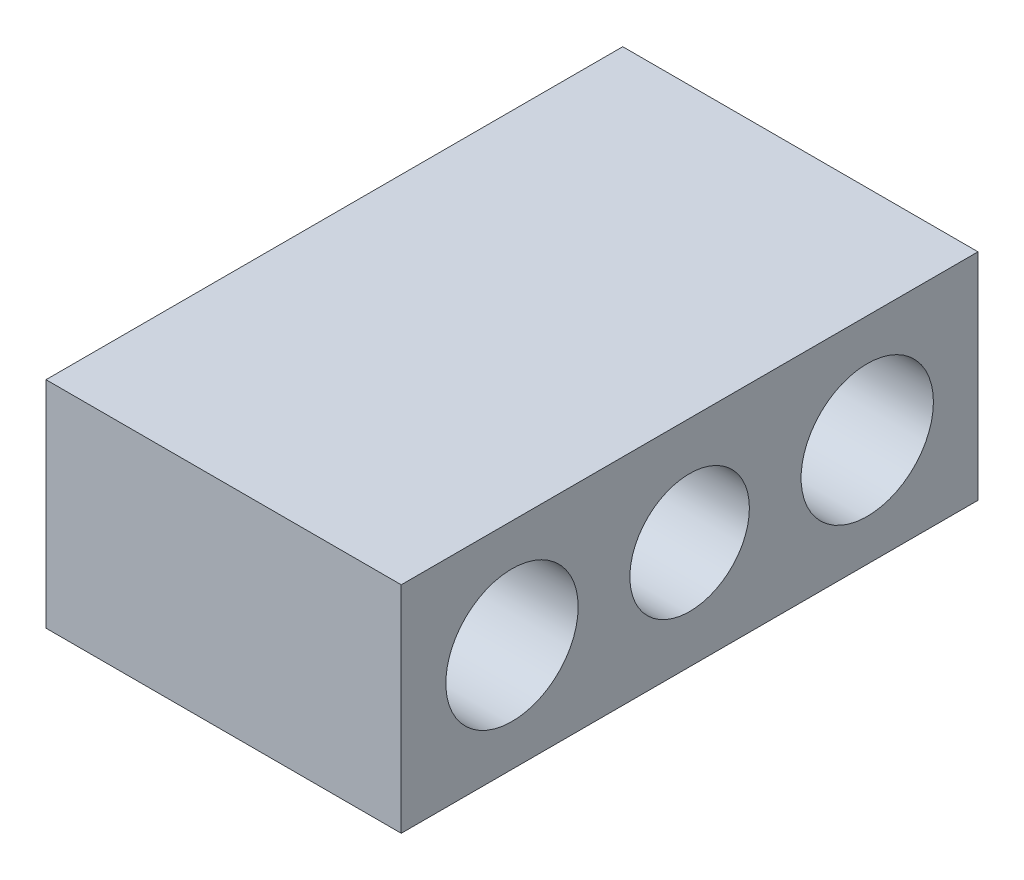
ISO-10303-21;
HEADER;
FILE_DESCRIPTION(('STEP AP214'),'2;1');
FILE_NAME('part.step','',(''),(''),'','','');
FILE_SCHEMA(('AUTOMOTIVE_DESIGN { 1 0 10303 214 1 1 1 1 }'));
ENDSEC;
DATA;
#1=APPLICATION_CONTEXT('core data for automotive mechanical design processes');
#2=APPLICATION_PROTOCOL_DEFINITION('international standard','automotive_design',2000,#1);
#3=PRODUCT_CONTEXT('',#1,'mechanical');
#4=PRODUCT('Part','Part','',(#3));
#5=PRODUCT_RELATED_PRODUCT_CATEGORY('part','',(#4));
#6=PRODUCT_DEFINITION_FORMATION('','',#4);
#7=PRODUCT_DEFINITION_CONTEXT('part definition',#1,'design');
#8=PRODUCT_DEFINITION('design','',#6,#7);
#9=PRODUCT_DEFINITION_SHAPE('','',#8);
#10=(LENGTH_UNIT() NAMED_UNIT(*) SI_UNIT(.MILLI.,.METRE.));
#11=(NAMED_UNIT(*) PLANE_ANGLE_UNIT() SI_UNIT($,.RADIAN.));
#12=(NAMED_UNIT(*) SI_UNIT($,.STERADIAN.) SOLID_ANGLE_UNIT());
#13=UNCERTAINTY_MEASURE_WITH_UNIT(LENGTH_MEASURE(1.E-05),#10,'distance_accuracy_value','');
#14=(GEOMETRIC_REPRESENTATION_CONTEXT(3) GLOBAL_UNCERTAINTY_ASSIGNED_CONTEXT((#13)) GLOBAL_UNIT_ASSIGNED_CONTEXT((#10,
#11,#12)) REPRESENTATION_CONTEXT('',''));
#15=CARTESIAN_POINT('',(0.,0.,0.));
#16=DIRECTION('',(0.,0.,1.));
#17=DIRECTION('',(1.,0.,0.));
#18=AXIS2_PLACEMENT_3D('',#15,#16,#17);
#19=CARTESIAN_POINT('',(0.,51.5,0.));
#20=DIRECTION('',(1.,0.,0.));
#21=DIRECTION('',(0.,0.,-1.));
#22=AXIS2_PLACEMENT_3D('',#19,#20,#21);
#23=PLANE('',#22);
#24=CARTESIAN_POINT('',(0.,25.75,-111.5));
#25=DIRECTION('',(1.,0.,0.));
#26=DIRECTION('',(0.,0.,-1.));
#27=AXIS2_PLACEMENT_3D('',#24,#25,#26);
#28=CIRCLE('',#27,15.83);
#29=CARTESIAN_POINT('',(0.,25.75,-127.33));
#30=VERTEX_POINT('',#29);
#31=EDGE_CURVE('E122',#30,#30,#28,.F.);
#32=ORIENTED_EDGE('',*,*,#31,.F.);
#33=EDGE_LOOP('',(#32));
#34=FACE_BOUND('',#33,.T.);
#35=CARTESIAN_POINT('',(0.,25.75,-26.5));
#36=DIRECTION('',(1.,0.,0.));
#37=DIRECTION('',(0.,0.,-1.));
#38=AXIS2_PLACEMENT_3D('',#35,#36,#37);
#39=CIRCLE('',#38,15.83);
#40=CARTESIAN_POINT('',(0.,25.75,-42.33));
#41=VERTEX_POINT('',#40);
#42=EDGE_CURVE('E116',#41,#41,#39,.F.);
#43=ORIENTED_EDGE('',*,*,#42,.F.);
#44=EDGE_LOOP('',(#43));
#45=FACE_BOUND('',#44,.T.);
#46=CARTESIAN_POINT('',(0.,25.75,-69.));
#47=DIRECTION('',(1.,0.,0.));
#48=DIRECTION('',(0.,0.,-1.));
#49=AXIS2_PLACEMENT_3D('',#46,#47,#48);
#50=CIRCLE('',#49,14.3);
#51=CARTESIAN_POINT('',(0.,25.75,-83.3));
#52=VERTEX_POINT('',#51);
#53=EDGE_CURVE('E100',#52,#52,#50,.F.);
#54=ORIENTED_EDGE('',*,*,#53,.F.);
#55=EDGE_LOOP('',(#54));
#56=FACE_BOUND('',#55,.T.);
#57=DIRECTION('',(0.,0.,1.));
#58=VECTOR('',#57,1.);
#59=CARTESIAN_POINT('',(0.,0.,0.));
#60=LINE('',#59,#58);
#61=CARTESIAN_POINT('',(0.,0.,-138.));
#62=VERTEX_POINT('',#61);
#63=CARTESIAN_POINT('',(0.,0.,0.));
#64=VERTEX_POINT('',#63);
#65=EDGE_CURVE('E97',#62,#64,#60,.T.);
#66=ORIENTED_EDGE('',*,*,#65,.T.);
#67=DIRECTION('',(0.,-1.,0.));
#68=VECTOR('',#67,1.);
#69=CARTESIAN_POINT('',(0.,51.5,0.));
#70=LINE('',#69,#68);
#71=CARTESIAN_POINT('',(0.,51.5,0.));
#72=VERTEX_POINT('',#71);
#73=EDGE_CURVE('E11',#72,#64,#70,.T.);
#74=ORIENTED_EDGE('',*,*,#73,.F.);
#75=DIRECTION('',(0.,0.,1.));
#76=VECTOR('',#75,1.);
#77=CARTESIAN_POINT('',(0.,51.5,0.));
#78=LINE('',#77,#76);
#79=CARTESIAN_POINT('',(0.,51.5,-138.));
#80=VERTEX_POINT('',#79);
#81=EDGE_CURVE('E85',#80,#72,#78,.T.);
#82=ORIENTED_EDGE('',*,*,#81,.F.);
#83=DIRECTION('',(0.,-1.,0.));
#84=VECTOR('',#83,1.);
#85=CARTESIAN_POINT('',(0.,51.5,-138.));
#86=LINE('',#85,#84);
#87=EDGE_CURVE('E93',#80,#62,#86,.T.);
#88=ORIENTED_EDGE('',*,*,#87,.T.);
#89=EDGE_LOOP('',(#66,#74,#82,#88));
#90=FACE_BOUND('',#89,.T.);
#91=ADVANCED_FACE('F34',(#34,#45,#56,#90),#23,.F.);
#92=CARTESIAN_POINT('',(0.,51.5,0.));
#93=DIRECTION('',(0.,0.,-1.));
#94=DIRECTION('',(-1.,0.,0.));
#95=AXIS2_PLACEMENT_3D('',#92,#93,#94);
#96=PLANE('',#95);
#97=DIRECTION('',(1.,0.,0.));
#98=VECTOR('',#97,1.);
#99=CARTESIAN_POINT('',(0.,0.,0.));
#100=LINE('',#99,#98);
#101=CARTESIAN_POINT('',(85.,0.,0.));
#102=VERTEX_POINT('',#101);
#103=EDGE_CURVE('E89',#64,#102,#100,.T.);
#104=ORIENTED_EDGE('',*,*,#103,.T.);
#105=DIRECTION('',(0.,-1.,0.));
#106=VECTOR('',#105,1.);
#107=CARTESIAN_POINT('',(85.,51.5,0.));
#108=LINE('',#107,#106);
#109=CARTESIAN_POINT('',(85.,51.5,0.));
#110=VERTEX_POINT('',#109);
#111=EDGE_CURVE('E42',#110,#102,#108,.T.);
#112=ORIENTED_EDGE('',*,*,#111,.F.);
#113=DIRECTION('',(1.,0.,0.));
#114=VECTOR('',#113,1.);
#115=CARTESIAN_POINT('',(0.,51.5,0.));
#116=LINE('',#115,#114);
#117=EDGE_CURVE('E80',#72,#110,#116,.T.);
#118=ORIENTED_EDGE('',*,*,#117,.F.);
#119=ORIENTED_EDGE('',*,*,#73,.T.);
#120=EDGE_LOOP('',(#104,#112,#118,#119));
#121=FACE_BOUND('',#120,.T.);
#122=ADVANCED_FACE('F88',(#121),#96,.F.);
#123=CARTESIAN_POINT('',(85.,51.5,0.));
#124=DIRECTION('',(-1.,0.,0.));
#125=DIRECTION('',(0.,0.,1.));
#126=AXIS2_PLACEMENT_3D('',#123,#124,#125);
#127=PLANE('',#126);
#128=CARTESIAN_POINT('',(85.,25.75,-111.5));
#129=DIRECTION('',(1.,0.,0.));
#130=DIRECTION('',(0.,0.,-1.));
#131=AXIS2_PLACEMENT_3D('',#128,#129,#130);
#132=CIRCLE('',#131,15.83);
#133=CARTESIAN_POINT('',(85.,25.75,-127.33));
#134=VERTEX_POINT('',#133);
#135=EDGE_CURVE('E125',#134,#134,#132,.T.);
#136=ORIENTED_EDGE('',*,*,#135,.F.);
#137=EDGE_LOOP('',(#136));
#138=FACE_BOUND('',#137,.T.);
#139=CARTESIAN_POINT('',(85.,25.75,-26.5));
#140=DIRECTION('',(1.,0.,0.));
#141=DIRECTION('',(0.,0.,-1.));
#142=AXIS2_PLACEMENT_3D('',#139,#140,#141);
#143=CIRCLE('',#142,15.83);
#144=CARTESIAN_POINT('',(85.,25.75,-42.33));
#145=VERTEX_POINT('',#144);
#146=EDGE_CURVE('E119',#145,#145,#143,.T.);
#147=ORIENTED_EDGE('',*,*,#146,.F.);
#148=EDGE_LOOP('',(#147));
#149=FACE_BOUND('',#148,.T.);
#150=CARTESIAN_POINT('',(85.,25.75,-69.));
#151=DIRECTION('',(1.,0.,0.));
#152=DIRECTION('',(0.,0.,-1.));
#153=AXIS2_PLACEMENT_3D('',#150,#151,#152);
#154=CIRCLE('',#153,14.3);
#155=CARTESIAN_POINT('',(85.,25.75,-83.3));
#156=VERTEX_POINT('',#155);
#157=EDGE_CURVE('E113',#156,#156,#154,.T.);
#158=ORIENTED_EDGE('',*,*,#157,.F.);
#159=EDGE_LOOP('',(#158));
#160=FACE_BOUND('',#159,.T.);
#161=DIRECTION('',(0.,0.,-1.));
#162=VECTOR('',#161,1.);
#163=CARTESIAN_POINT('',(85.,0.,0.));
#164=LINE('',#163,#162);
#165=CARTESIAN_POINT('',(85.,0.,-138.));
#166=VERTEX_POINT('',#165);
#167=EDGE_CURVE('E67',#102,#166,#164,.T.);
#168=ORIENTED_EDGE('',*,*,#167,.T.);
#169=DIRECTION('',(0.,-1.,0.));
#170=VECTOR('',#169,1.);
#171=CARTESIAN_POINT('',(85.,51.5,-138.));
#172=LINE('',#171,#170);
#173=CARTESIAN_POINT('',(85.,51.5,-138.));
#174=VERTEX_POINT('',#173);
#175=EDGE_CURVE('E90',#174,#166,#172,.T.);
#176=ORIENTED_EDGE('',*,*,#175,.F.);
#177=DIRECTION('',(0.,0.,-1.));
#178=VECTOR('',#177,1.);
#179=CARTESIAN_POINT('',(85.,51.5,0.));
#180=LINE('',#179,#178);
#181=EDGE_CURVE('E83',#110,#174,#180,.T.);
#182=ORIENTED_EDGE('',*,*,#181,.F.);
#183=ORIENTED_EDGE('',*,*,#111,.T.);
#184=EDGE_LOOP('',(#168,#176,#182,#183));
#185=FACE_BOUND('',#184,.T.);
#186=ADVANCED_FACE('F91',(#138,#149,#160,#185),#127,.F.);
#187=CARTESIAN_POINT('',(0.,51.5,-138.));
#188=DIRECTION('',(0.,0.,1.));
#189=DIRECTION('',(1.,0.,0.));
#190=AXIS2_PLACEMENT_3D('',#187,#188,#189);
#191=PLANE('',#190);
#192=DIRECTION('',(-1.,0.,0.));
#193=VECTOR('',#192,1.);
#194=CARTESIAN_POINT('',(0.,0.,-138.));
#195=LINE('',#194,#193);
#196=EDGE_CURVE('E73',#166,#62,#195,.T.);
#197=ORIENTED_EDGE('',*,*,#196,.T.);
#198=ORIENTED_EDGE('',*,*,#87,.F.);
#199=DIRECTION('',(-1.,0.,0.));
#200=VECTOR('',#199,1.);
#201=CARTESIAN_POINT('',(0.,51.5,-138.));
#202=LINE('',#201,#200);
#203=EDGE_CURVE('E50',#174,#80,#202,.T.);
#204=ORIENTED_EDGE('',*,*,#203,.F.);
#205=ORIENTED_EDGE('',*,*,#175,.T.);
#206=EDGE_LOOP('',(#197,#198,#204,#205));
#207=FACE_BOUND('',#206,.T.);
#208=ADVANCED_FACE('F105',(#207),#191,.F.);
#209=CARTESIAN_POINT('',(0.,51.5,-138.));
#210=DIRECTION('',(0.,-1.,0.));
#211=DIRECTION('',(0.,0.,-1.));
#212=AXIS2_PLACEMENT_3D('',#209,#210,#211);
#213=PLANE('',#212);
#214=ORIENTED_EDGE('',*,*,#81,.T.);
#215=ORIENTED_EDGE('',*,*,#117,.T.);
#216=ORIENTED_EDGE('',*,*,#181,.T.);
#217=ORIENTED_EDGE('',*,*,#203,.T.);
#218=EDGE_LOOP('',(#214,#215,#216,#217));
#219=FACE_BOUND('',#218,.T.);
#220=ADVANCED_FACE('F81',(#219),#213,.F.);
#221=CARTESIAN_POINT('',(0.,0.,-138.));
#222=DIRECTION('',(0.,-1.,0.));
#223=DIRECTION('',(0.,0.,-1.));
#224=AXIS2_PLACEMENT_3D('',#221,#222,#223);
#225=PLANE('',#224);
#226=ORIENTED_EDGE('',*,*,#65,.F.);
#227=ORIENTED_EDGE('',*,*,#196,.F.);
#228=ORIENTED_EDGE('',*,*,#167,.F.);
#229=ORIENTED_EDGE('',*,*,#103,.F.);
#230=EDGE_LOOP('',(#226,#227,#228,#229));
#231=FACE_BOUND('',#230,.T.);
#232=ADVANCED_FACE('F108',(#231),#225,.T.);
#233=CARTESIAN_POINT('',(-0.001000000000001,25.75,-69.));
#234=DIRECTION('',(1.,0.,0.));
#235=DIRECTION('',(0.,0.,-1.));
#236=AXIS2_PLACEMENT_3D('',#233,#234,#235);
#237=CYLINDRICAL_SURFACE('',#236,14.3);
#238=ORIENTED_EDGE('',*,*,#157,.T.);
#239=EDGE_LOOP('',(#238));
#240=FACE_BOUND('',#239,.T.);
#241=ORIENTED_EDGE('',*,*,#53,.T.);
#242=EDGE_LOOP('',(#241));
#243=FACE_BOUND('',#242,.T.);
#244=ADVANCED_FACE('F139',(#240,#243),#237,.F.);
#245=CARTESIAN_POINT('',(-0.001000000000001,25.75,-26.5));
#246=DIRECTION('',(1.,0.,0.));
#247=DIRECTION('',(0.,0.,-1.));
#248=AXIS2_PLACEMENT_3D('',#245,#246,#247);
#249=CYLINDRICAL_SURFACE('',#248,15.83);
#250=ORIENTED_EDGE('',*,*,#146,.T.);
#251=EDGE_LOOP('',(#250));
#252=FACE_BOUND('',#251,.T.);
#253=ORIENTED_EDGE('',*,*,#42,.T.);
#254=EDGE_LOOP('',(#253));
#255=FACE_BOUND('',#254,.T.);
#256=ADVANCED_FACE('F142',(#252,#255),#249,.F.);
#257=CARTESIAN_POINT('',(-0.001000000000001,25.75,-111.5));
#258=DIRECTION('',(1.,0.,0.));
#259=DIRECTION('',(0.,0.,-1.));
#260=AXIS2_PLACEMENT_3D('',#257,#258,#259);
#261=CYLINDRICAL_SURFACE('',#260,15.83);
#262=ORIENTED_EDGE('',*,*,#135,.T.);
#263=EDGE_LOOP('',(#262));
#264=FACE_BOUND('',#263,.T.);
#265=ORIENTED_EDGE('',*,*,#31,.T.);
#266=EDGE_LOOP('',(#265));
#267=FACE_BOUND('',#266,.T.);
#268=ADVANCED_FACE('F129',(#264,#267),#261,.F.);
#269=CLOSED_SHELL('',(#91,#122,#186,#208,#220,#232,#244,#256,#268));
#270=MANIFOLD_SOLID_BREP('B2',#269);
#271=ADVANCED_BREP_SHAPE_REPRESENTATION('',(#18,#270),#14);
#272=SHAPE_DEFINITION_REPRESENTATION(#9,#271);
ENDSEC;
END-ISO-10303-21;
